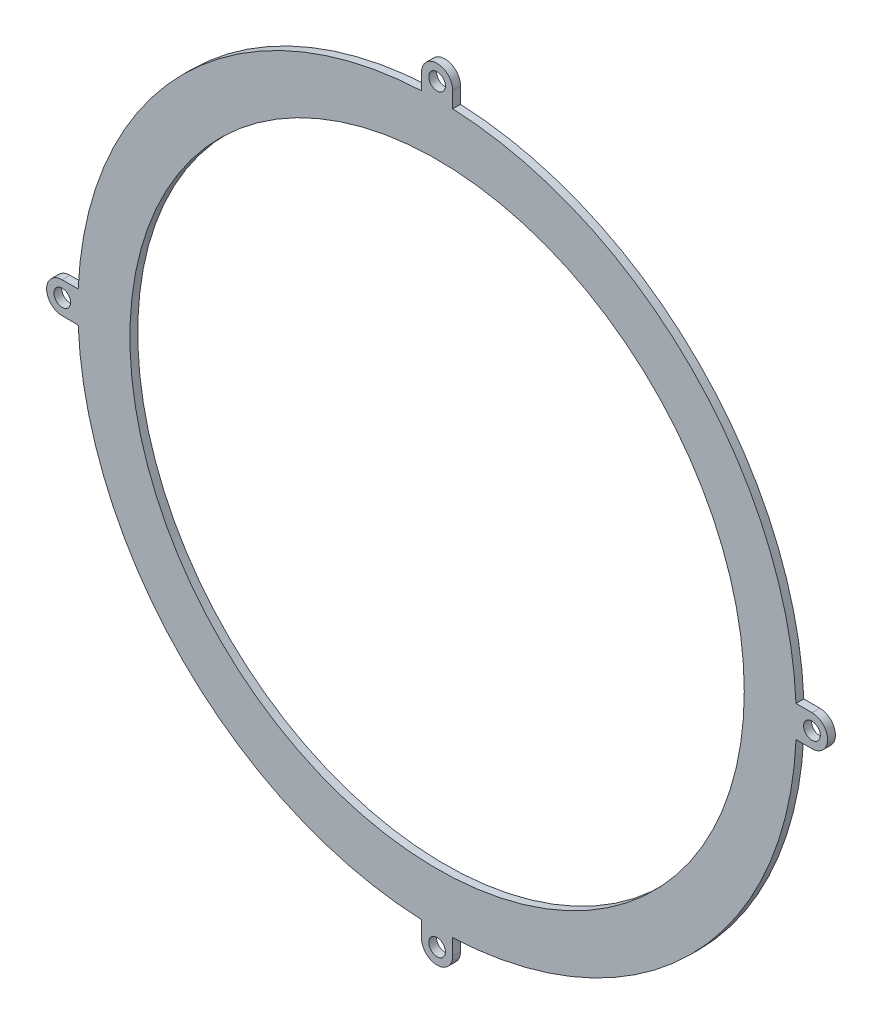
ISO-10303-21;
HEADER;
FILE_DESCRIPTION(('STEP AP214'),'2;1');
FILE_NAME('part.step','',(''),(''),'','','');
FILE_SCHEMA(('AUTOMOTIVE_DESIGN { 1 0 10303 214 1 1 1 1 }'));
ENDSEC;
DATA;
#1=APPLICATION_CONTEXT('core data for automotive mechanical design processes');
#2=APPLICATION_PROTOCOL_DEFINITION('international standard','automotive_design',2000,#1);
#3=PRODUCT_CONTEXT('',#1,'mechanical');
#4=PRODUCT('Part','Part','',(#3));
#5=PRODUCT_RELATED_PRODUCT_CATEGORY('part','',(#4));
#6=PRODUCT_DEFINITION_FORMATION('','',#4);
#7=PRODUCT_DEFINITION_CONTEXT('part definition',#1,'design');
#8=PRODUCT_DEFINITION('design','',#6,#7);
#9=PRODUCT_DEFINITION_SHAPE('','',#8);
#10=(LENGTH_UNIT() NAMED_UNIT(*) SI_UNIT(.MILLI.,.METRE.));
#11=(NAMED_UNIT(*) PLANE_ANGLE_UNIT() SI_UNIT($,.RADIAN.));
#12=(NAMED_UNIT(*) SI_UNIT($,.STERADIAN.) SOLID_ANGLE_UNIT());
#13=UNCERTAINTY_MEASURE_WITH_UNIT(LENGTH_MEASURE(1.E-05),#10,'distance_accuracy_value','');
#14=(GEOMETRIC_REPRESENTATION_CONTEXT(3) GLOBAL_UNCERTAINTY_ASSIGNED_CONTEXT((#13)) GLOBAL_UNIT_ASSIGNED_CONTEXT((#10,
#11,#12)) REPRESENTATION_CONTEXT('',''));
#15=CARTESIAN_POINT('',(0.,0.,0.));
#16=DIRECTION('',(0.,0.,1.));
#17=DIRECTION('',(1.,0.,0.));
#18=AXIS2_PLACEMENT_3D('',#15,#16,#17);
#19=CARTESIAN_POINT('',(0.,72.,1.5));
#20=DIRECTION('',(0.,0.,1.));
#21=DIRECTION('',(1.,0.,0.));
#22=AXIS2_PLACEMENT_3D('',#19,#20,#21);
#23=PLANE('',#22);
#24=CARTESIAN_POINT('',(-5.02773312793411E-13,-72.,1.5));
#25=DIRECTION('',(0.,0.,1.));
#26=DIRECTION('',(1.,0.,0.));
#27=AXIS2_PLACEMENT_3D('',#24,#25,#26);
#28=CIRCLE('',#27,1.6);
#29=CARTESIAN_POINT('',(1.5999999999995,-72.,1.5));
#30=VERTEX_POINT('',#29);
#31=EDGE_CURVE('E348',#30,#30,#28,.T.);
#32=ORIENTED_EDGE('',*,*,#31,.F.);
#33=EDGE_LOOP('',(#32));
#34=FACE_BOUND('',#33,.T.);
#35=CARTESIAN_POINT('',(0.,72.,1.5));
#36=DIRECTION('',(0.,0.,1.));
#37=DIRECTION('',(1.,0.,0.));
#38=AXIS2_PLACEMENT_3D('',#35,#36,#37);
#39=CIRCLE('',#38,1.6);
#40=CARTESIAN_POINT('',(1.6,72.,1.5));
#41=VERTEX_POINT('',#40);
#42=EDGE_CURVE('E360',#41,#41,#39,.T.);
#43=ORIENTED_EDGE('',*,*,#42,.F.);
#44=EDGE_LOOP('',(#43));
#45=FACE_BOUND('',#44,.T.);
#46=CARTESIAN_POINT('',(0.,72.,1.5));
#47=DIRECTION('',(0.,0.,1.));
#48=DIRECTION('',(1.,0.,0.));
#49=AXIS2_PLACEMENT_3D('',#46,#47,#48);
#50=CIRCLE('',#49,3.);
#51=CARTESIAN_POINT('',(3.,72.,1.5));
#52=VERTEX_POINT('',#51);
#53=CARTESIAN_POINT('',(-3.,72.,1.5));
#54=VERTEX_POINT('',#53);
#55=EDGE_CURVE('E210',#52,#54,#50,.T.);
#56=ORIENTED_EDGE('',*,*,#55,.T.);
#57=DIRECTION('',(0.,-1.,0.));
#58=VECTOR('',#57,1.);
#59=CARTESIAN_POINT('',(-3.,72.,1.5));
#60=LINE('',#59,#58);
#61=CARTESIAN_POINT('',(-3.,68.9347517584563,1.5));
#62=VERTEX_POINT('',#61);
#63=EDGE_CURVE('E118',#54,#62,#60,.T.);
#64=ORIENTED_EDGE('',*,*,#63,.T.);
#65=CARTESIAN_POINT('',(0.,0.,1.5));
#66=DIRECTION('',(0.,0.,1.));
#67=DIRECTION('',(1.,0.,0.));
#68=AXIS2_PLACEMENT_3D('',#65,#66,#67);
#69=CIRCLE('',#68,69.);
#70=CARTESIAN_POINT('',(-68.9347517584563,3.00000000000092,1.5));
#71=VERTEX_POINT('',#70);
#72=EDGE_CURVE('E249',#62,#71,#69,.T.);
#73=ORIENTED_EDGE('',*,*,#72,.T.);
#74=DIRECTION('',(-1.,0.,0.));
#75=VECTOR('',#74,1.);
#76=CARTESIAN_POINT('',(-68.9347517584563,3.00000000000092,1.5));
#77=LINE('',#76,#75);
#78=CARTESIAN_POINT('',(-72.,3.00000000000075,1.5));
#79=VERTEX_POINT('',#78);
#80=EDGE_CURVE('E268',#71,#79,#77,.T.);
#81=ORIENTED_EDGE('',*,*,#80,.T.);
#82=CARTESIAN_POINT('',(-72.,7.54159969190117E-13,1.5));
#83=DIRECTION('',(0.,0.,1.));
#84=DIRECTION('',(1.,0.,0.));
#85=AXIS2_PLACEMENT_3D('',#82,#83,#84);
#86=CIRCLE('',#85,3.);
#87=CARTESIAN_POINT('',(-72.,-2.99999999999925,1.5));
#88=VERTEX_POINT('',#87);
#89=EDGE_CURVE('E265',#79,#88,#86,.T.);
#90=ORIENTED_EDGE('',*,*,#89,.T.);
#91=DIRECTION('',(1.,0.,0.));
#92=VECTOR('',#91,1.);
#93=CARTESIAN_POINT('',(-72.,-2.99999999999925,1.5));
#94=LINE('',#93,#92);
#95=CARTESIAN_POINT('',(-68.9347517584564,-2.99999999999928,1.5));
#96=VERTEX_POINT('',#95);
#97=EDGE_CURVE('E267',#88,#96,#94,.T.);
#98=ORIENTED_EDGE('',*,*,#97,.T.);
#99=CARTESIAN_POINT('',(0.,0.,1.5));
#100=DIRECTION('',(0.,0.,1.));
#101=DIRECTION('',(1.,0.,0.));
#102=AXIS2_PLACEMENT_3D('',#99,#100,#101);
#103=CIRCLE('',#102,69.);
#104=CARTESIAN_POINT('',(-3.00000000000071,-68.9347517584563,1.5));
#105=VERTEX_POINT('',#104);
#106=EDGE_CURVE('E270',#96,#105,#103,.T.);
#107=ORIENTED_EDGE('',*,*,#106,.T.);
#108=DIRECTION('',(0.,-1.,0.));
#109=VECTOR('',#108,1.);
#110=CARTESIAN_POINT('',(-3.00000000000068,-68.9347517584563,1.5));
#111=LINE('',#110,#109);
#112=CARTESIAN_POINT('',(-3.0000000000005,-72.,1.5));
#113=VERTEX_POINT('',#112);
#114=EDGE_CURVE('E276',#105,#113,#111,.T.);
#115=ORIENTED_EDGE('',*,*,#114,.T.);
#116=CARTESIAN_POINT('',(-5.02773312793411E-13,-72.,1.5));
#117=DIRECTION('',(0.,0.,1.));
#118=DIRECTION('',(1.,0.,0.));
#119=AXIS2_PLACEMENT_3D('',#116,#117,#118);
#120=CIRCLE('',#119,3.);
#121=CARTESIAN_POINT('',(2.9999999999995,-72.,1.5));
#122=VERTEX_POINT('',#121);
#123=EDGE_CURVE('E278',#113,#122,#120,.T.);
#124=ORIENTED_EDGE('',*,*,#123,.T.);
#125=DIRECTION('',(0.,1.,0.));
#126=VECTOR('',#125,1.);
#127=CARTESIAN_POINT('',(2.9999999999995,-72.,1.5));
#128=LINE('',#127,#126);
#129=CARTESIAN_POINT('',(2.99999999999952,-68.9347517584564,1.5));
#130=VERTEX_POINT('',#129);
#131=EDGE_CURVE('E280',#122,#130,#128,.T.);
#132=ORIENTED_EDGE('',*,*,#131,.T.);
#133=CARTESIAN_POINT('',(0.,0.,1.5));
#134=DIRECTION('',(0.,0.,1.));
#135=DIRECTION('',(1.,0.,0.));
#136=AXIS2_PLACEMENT_3D('',#133,#134,#135);
#137=CIRCLE('',#136,69.);
#138=CARTESIAN_POINT('',(68.9347517584563,-3.00000000000047,1.5));
#139=VERTEX_POINT('',#138);
#140=EDGE_CURVE('E282',#130,#139,#137,.T.);
#141=ORIENTED_EDGE('',*,*,#140,.T.);
#142=DIRECTION('',(1.,0.,0.));
#143=VECTOR('',#142,1.);
#144=CARTESIAN_POINT('',(68.9347517584563,-3.00000000000044,1.5));
#145=LINE('',#144,#143);
#146=CARTESIAN_POINT('',(72.,-3.00000000000025,1.5));
#147=VERTEX_POINT('',#146);
#148=EDGE_CURVE('E284',#139,#147,#145,.T.);
#149=ORIENTED_EDGE('',*,*,#148,.T.);
#150=CARTESIAN_POINT('',(72.,-2.51386656396706E-13,1.5));
#151=DIRECTION('',(0.,0.,1.));
#152=DIRECTION('',(1.,0.,0.));
#153=AXIS2_PLACEMENT_3D('',#150,#151,#152);
#154=CIRCLE('',#153,3.);
#155=CARTESIAN_POINT('',(72.,2.99999999999975,1.5));
#156=VERTEX_POINT('',#155);
#157=EDGE_CURVE('E161',#147,#156,#154,.T.);
#158=ORIENTED_EDGE('',*,*,#157,.T.);
#159=DIRECTION('',(-1.,0.,0.));
#160=VECTOR('',#159,1.);
#161=CARTESIAN_POINT('',(72.,2.99999999999975,1.5));
#162=LINE('',#161,#160);
#163=CARTESIAN_POINT('',(68.9347517584563,2.99999999999976,1.5));
#164=VERTEX_POINT('',#163);
#165=EDGE_CURVE('E155',#156,#164,#162,.T.);
#166=ORIENTED_EDGE('',*,*,#165,.T.);
#167=CARTESIAN_POINT('',(0.,0.,1.5));
#168=DIRECTION('',(0.,0.,1.));
#169=DIRECTION('',(1.,0.,0.));
#170=AXIS2_PLACEMENT_3D('',#167,#168,#169);
#171=CIRCLE('',#170,69.);
#172=CARTESIAN_POINT('',(3.0000000000002,68.9347517584563,1.5));
#173=VERTEX_POINT('',#172);
#174=EDGE_CURVE('E159',#164,#173,#171,.T.);
#175=ORIENTED_EDGE('',*,*,#174,.T.);
#176=DIRECTION('',(0.,1.,0.));
#177=VECTOR('',#176,1.);
#178=CARTESIAN_POINT('',(3.0000000000002,68.9347517584563,1.5));
#179=LINE('',#178,#177);
#180=EDGE_CURVE('E51',#173,#52,#179,.T.);
#181=ORIENTED_EDGE('',*,*,#180,.T.);
#182=EDGE_LOOP('',(#56,#64,#73,#81,#90,#98,#107,#115,#124,#132,#141,#149,#158,#166,#175,#181));
#183=FACE_BOUND('',#182,.T.);
#184=CARTESIAN_POINT('',(0.,0.,1.5));
#185=DIRECTION('',(0.,0.,1.));
#186=DIRECTION('',(1.,0.,0.));
#187=AXIS2_PLACEMENT_3D('',#184,#185,#186);
#188=CIRCLE('',#187,59.);
#189=CARTESIAN_POINT('',(59.,0.,1.5));
#190=VERTEX_POINT('',#189);
#191=EDGE_CURVE('E183',#190,#190,#188,.T.);
#192=ORIENTED_EDGE('',*,*,#191,.F.);
#193=EDGE_LOOP('',(#192));
#194=FACE_BOUND('',#193,.T.);
#195=CARTESIAN_POINT('',(72.,-2.51386656396706E-13,1.5));
#196=DIRECTION('',(0.,0.,1.));
#197=DIRECTION('',(1.,0.,0.));
#198=AXIS2_PLACEMENT_3D('',#195,#196,#197);
#199=CIRCLE('',#198,1.6);
#200=CARTESIAN_POINT('',(73.6,-2.51386656396706E-13,1.5));
#201=VERTEX_POINT('',#200);
#202=EDGE_CURVE('E354',#201,#201,#199,.T.);
#203=ORIENTED_EDGE('',*,*,#202,.F.);
#204=EDGE_LOOP('',(#203));
#205=FACE_BOUND('',#204,.T.);
#206=CARTESIAN_POINT('',(-72.,7.54159969190117E-13,1.5));
#207=DIRECTION('',(0.,0.,1.));
#208=DIRECTION('',(1.,0.,0.));
#209=AXIS2_PLACEMENT_3D('',#206,#207,#208);
#210=CIRCLE('',#209,1.6);
#211=CARTESIAN_POINT('',(-70.4,7.54159969190117E-13,1.5));
#212=VERTEX_POINT('',#211);
#213=EDGE_CURVE('E339',#212,#212,#210,.T.);
#214=ORIENTED_EDGE('',*,*,#213,.F.);
#215=EDGE_LOOP('',(#214));
#216=FACE_BOUND('',#215,.T.);
#217=ADVANCED_FACE('F34',(#34,#45,#183,#194,#205,#216),#23,.T.);
#218=CARTESIAN_POINT('',(0.,72.,0.));
#219=DIRECTION('',(0.,0.,1.));
#220=DIRECTION('',(1.,0.,0.));
#221=AXIS2_PLACEMENT_3D('',#218,#219,#220);
#222=PLANE('',#221);
#223=CARTESIAN_POINT('',(0.,72.,0.));
#224=DIRECTION('',(0.,0.,1.));
#225=DIRECTION('',(1.,0.,0.));
#226=AXIS2_PLACEMENT_3D('',#223,#224,#225);
#227=CIRCLE('',#226,3.);
#228=CARTESIAN_POINT('',(3.,72.,0.));
#229=VERTEX_POINT('',#228);
#230=CARTESIAN_POINT('',(-3.,72.,0.));
#231=VERTEX_POINT('',#230);
#232=EDGE_CURVE('E179',#229,#231,#227,.T.);
#233=ORIENTED_EDGE('',*,*,#232,.F.);
#234=DIRECTION('',(0.,1.,0.));
#235=VECTOR('',#234,1.);
#236=CARTESIAN_POINT('',(3.0000000000002,68.9347517584563,0.));
#237=LINE('',#236,#235);
#238=CARTESIAN_POINT('',(3.0000000000002,68.9347517584563,0.));
#239=VERTEX_POINT('',#238);
#240=EDGE_CURVE('E110',#239,#229,#237,.T.);
#241=ORIENTED_EDGE('',*,*,#240,.F.);
#242=CARTESIAN_POINT('',(0.,0.,0.));
#243=DIRECTION('',(0.,0.,1.));
#244=DIRECTION('',(1.,0.,0.));
#245=AXIS2_PLACEMENT_3D('',#242,#243,#244);
#246=CIRCLE('',#245,69.);
#247=CARTESIAN_POINT('',(68.9347517584563,2.99999999999976,0.));
#248=VERTEX_POINT('',#247);
#249=EDGE_CURVE('E104',#248,#239,#246,.T.);
#250=ORIENTED_EDGE('',*,*,#249,.F.);
#251=DIRECTION('',(-1.,0.,0.));
#252=VECTOR('',#251,1.);
#253=CARTESIAN_POINT('',(72.,2.99999999999975,0.));
#254=LINE('',#253,#252);
#255=CARTESIAN_POINT('',(72.,2.99999999999975,0.));
#256=VERTEX_POINT('',#255);
#257=EDGE_CURVE('E169',#256,#248,#254,.T.);
#258=ORIENTED_EDGE('',*,*,#257,.F.);
#259=CARTESIAN_POINT('',(72.,-2.51386656396706E-13,0.));
#260=DIRECTION('',(0.,0.,1.));
#261=DIRECTION('',(1.,0.,0.));
#262=AXIS2_PLACEMENT_3D('',#259,#260,#261);
#263=CIRCLE('',#262,3.);
#264=CARTESIAN_POINT('',(72.,-3.00000000000025,0.));
#265=VERTEX_POINT('',#264);
#266=EDGE_CURVE('E205',#265,#256,#263,.T.);
#267=ORIENTED_EDGE('',*,*,#266,.F.);
#268=DIRECTION('',(1.,0.,0.));
#269=VECTOR('',#268,1.);
#270=CARTESIAN_POINT('',(68.9347517584563,-3.00000000000044,0.));
#271=LINE('',#270,#269);
#272=CARTESIAN_POINT('',(68.9347517584563,-3.00000000000047,0.));
#273=VERTEX_POINT('',#272);
#274=EDGE_CURVE('E203',#273,#265,#271,.T.);
#275=ORIENTED_EDGE('',*,*,#274,.F.);
#276=CARTESIAN_POINT('',(0.,0.,0.));
#277=DIRECTION('',(0.,0.,1.));
#278=DIRECTION('',(1.,0.,0.));
#279=AXIS2_PLACEMENT_3D('',#276,#277,#278);
#280=CIRCLE('',#279,69.);
#281=CARTESIAN_POINT('',(2.99999999999952,-68.9347517584564,0.));
#282=VERTEX_POINT('',#281);
#283=EDGE_CURVE('E201',#282,#273,#280,.T.);
#284=ORIENTED_EDGE('',*,*,#283,.F.);
#285=DIRECTION('',(0.,1.,0.));
#286=VECTOR('',#285,1.);
#287=CARTESIAN_POINT('',(2.9999999999995,-72.,0.));
#288=LINE('',#287,#286);
#289=CARTESIAN_POINT('',(2.9999999999995,-72.,0.));
#290=VERTEX_POINT('',#289);
#291=EDGE_CURVE('E199',#290,#282,#288,.T.);
#292=ORIENTED_EDGE('',*,*,#291,.F.);
#293=CARTESIAN_POINT('',(-5.02773312793411E-13,-72.,0.));
#294=DIRECTION('',(0.,0.,1.));
#295=DIRECTION('',(1.,0.,0.));
#296=AXIS2_PLACEMENT_3D('',#293,#294,#295);
#297=CIRCLE('',#296,3.);
#298=CARTESIAN_POINT('',(-3.0000000000005,-72.,0.));
#299=VERTEX_POINT('',#298);
#300=EDGE_CURVE('E197',#299,#290,#297,.T.);
#301=ORIENTED_EDGE('',*,*,#300,.F.);
#302=DIRECTION('',(0.,-1.,0.));
#303=VECTOR('',#302,1.);
#304=CARTESIAN_POINT('',(-3.00000000000068,-68.9347517584563,0.));
#305=LINE('',#304,#303);
#306=CARTESIAN_POINT('',(-3.00000000000071,-68.9347517584563,0.));
#307=VERTEX_POINT('',#306);
#308=EDGE_CURVE('E195',#307,#299,#305,.T.);
#309=ORIENTED_EDGE('',*,*,#308,.F.);
#310=CARTESIAN_POINT('',(0.,0.,0.));
#311=DIRECTION('',(0.,0.,1.));
#312=DIRECTION('',(1.,0.,0.));
#313=AXIS2_PLACEMENT_3D('',#310,#311,#312);
#314=CIRCLE('',#313,69.);
#315=CARTESIAN_POINT('',(-68.9347517584564,-2.99999999999928,0.));
#316=VERTEX_POINT('',#315);
#317=EDGE_CURVE('E193',#316,#307,#314,.T.);
#318=ORIENTED_EDGE('',*,*,#317,.F.);
#319=DIRECTION('',(1.,0.,0.));
#320=VECTOR('',#319,1.);
#321=CARTESIAN_POINT('',(-72.,-2.99999999999925,0.));
#322=LINE('',#321,#320);
#323=CARTESIAN_POINT('',(-72.,-2.99999999999925,0.));
#324=VERTEX_POINT('',#323);
#325=EDGE_CURVE('E191',#324,#316,#322,.T.);
#326=ORIENTED_EDGE('',*,*,#325,.F.);
#327=CARTESIAN_POINT('',(-72.,7.54159969190117E-13,0.));
#328=DIRECTION('',(0.,0.,1.));
#329=DIRECTION('',(1.,0.,0.));
#330=AXIS2_PLACEMENT_3D('',#327,#328,#329);
#331=CIRCLE('',#330,3.);
#332=CARTESIAN_POINT('',(-72.,3.00000000000075,0.));
#333=VERTEX_POINT('',#332);
#334=EDGE_CURVE('E189',#333,#324,#331,.T.);
#335=ORIENTED_EDGE('',*,*,#334,.F.);
#336=DIRECTION('',(-1.,0.,0.));
#337=VECTOR('',#336,1.);
#338=CARTESIAN_POINT('',(-68.9347517584563,3.00000000000092,0.));
#339=LINE('',#338,#337);
#340=CARTESIAN_POINT('',(-68.9347517584563,3.00000000000092,0.));
#341=VERTEX_POINT('',#340);
#342=EDGE_CURVE('E187',#341,#333,#339,.T.);
#343=ORIENTED_EDGE('',*,*,#342,.F.);
#344=CARTESIAN_POINT('',(0.,0.,0.));
#345=DIRECTION('',(0.,0.,1.));
#346=DIRECTION('',(1.,0.,0.));
#347=AXIS2_PLACEMENT_3D('',#344,#345,#346);
#348=CIRCLE('',#347,69.);
#349=CARTESIAN_POINT('',(-3.,68.9347517584563,0.));
#350=VERTEX_POINT('',#349);
#351=EDGE_CURVE('E185',#350,#341,#348,.T.);
#352=ORIENTED_EDGE('',*,*,#351,.F.);
#353=DIRECTION('',(0.,-1.,0.));
#354=VECTOR('',#353,1.);
#355=CARTESIAN_POINT('',(-3.,72.,0.));
#356=LINE('',#355,#354);
#357=EDGE_CURVE('E182',#231,#350,#356,.T.);
#358=ORIENTED_EDGE('',*,*,#357,.F.);
#359=EDGE_LOOP('',(#233,#241,#250,#258,#267,#275,#284,#292,#301,#309,#318,#326,#335,#343,#352,#358));
#360=FACE_BOUND('',#359,.T.);
#361=CARTESIAN_POINT('',(0.,0.,0.));
#362=DIRECTION('',(0.,0.,1.));
#363=DIRECTION('',(1.,0.,0.));
#364=AXIS2_PLACEMENT_3D('',#361,#362,#363);
#365=CIRCLE('',#364,59.);
#366=CARTESIAN_POINT('',(59.,0.,0.));
#367=VERTEX_POINT('',#366);
#368=EDGE_CURVE('E363',#367,#367,#365,.T.);
#369=ORIENTED_EDGE('',*,*,#368,.T.);
#370=EDGE_LOOP('',(#369));
#371=FACE_BOUND('',#370,.T.);
#372=CARTESIAN_POINT('',(0.,72.,0.));
#373=DIRECTION('',(0.,0.,1.));
#374=DIRECTION('',(1.,0.,0.));
#375=AXIS2_PLACEMENT_3D('',#372,#373,#374);
#376=CIRCLE('',#375,1.6);
#377=CARTESIAN_POINT('',(1.6,72.,0.));
#378=VERTEX_POINT('',#377);
#379=EDGE_CURVE('E357',#378,#378,#376,.T.);
#380=ORIENTED_EDGE('',*,*,#379,.T.);
#381=EDGE_LOOP('',(#380));
#382=FACE_BOUND('',#381,.T.);
#383=CARTESIAN_POINT('',(72.,-2.51386656396706E-13,0.));
#384=DIRECTION('',(0.,0.,1.));
#385=DIRECTION('',(1.,0.,0.));
#386=AXIS2_PLACEMENT_3D('',#383,#384,#385);
#387=CIRCLE('',#386,1.6);
#388=CARTESIAN_POINT('',(73.6,-2.51386656396706E-13,0.));
#389=VERTEX_POINT('',#388);
#390=EDGE_CURVE('E351',#389,#389,#387,.T.);
#391=ORIENTED_EDGE('',*,*,#390,.T.);
#392=EDGE_LOOP('',(#391));
#393=FACE_BOUND('',#392,.T.);
#394=CARTESIAN_POINT('',(-5.02773312793411E-13,-72.,0.));
#395=DIRECTION('',(0.,0.,1.));
#396=DIRECTION('',(1.,0.,0.));
#397=AXIS2_PLACEMENT_3D('',#394,#395,#396);
#398=CIRCLE('',#397,1.6);
#399=CARTESIAN_POINT('',(1.5999999999995,-72.,0.));
#400=VERTEX_POINT('',#399);
#401=EDGE_CURVE('E345',#400,#400,#398,.T.);
#402=ORIENTED_EDGE('',*,*,#401,.T.);
#403=EDGE_LOOP('',(#402));
#404=FACE_BOUND('',#403,.T.);
#405=CARTESIAN_POINT('',(-72.,7.54159969190117E-13,0.));
#406=DIRECTION('',(0.,0.,1.));
#407=DIRECTION('',(1.,0.,0.));
#408=AXIS2_PLACEMENT_3D('',#405,#406,#407);
#409=CIRCLE('',#408,1.6);
#410=CARTESIAN_POINT('',(-70.4,7.54159969190117E-13,0.));
#411=VERTEX_POINT('',#410);
#412=EDGE_CURVE('E342',#411,#411,#409,.T.);
#413=ORIENTED_EDGE('',*,*,#412,.T.);
#414=EDGE_LOOP('',(#413));
#415=FACE_BOUND('',#414,.T.);
#416=ADVANCED_FACE('F253',(#360,#371,#382,#393,#404,#415),#222,.F.);
#417=CARTESIAN_POINT('',(0.,72.,1.5));
#418=DIRECTION('',(0.,0.,-1.));
#419=DIRECTION('',(-1.,0.,0.));
#420=AXIS2_PLACEMENT_3D('',#417,#418,#419);
#421=CYLINDRICAL_SURFACE('',#420,3.);
#422=ORIENTED_EDGE('',*,*,#232,.T.);
#423=DIRECTION('',(0.,0.,-1.));
#424=VECTOR('',#423,1.);
#425=CARTESIAN_POINT('',(-3.,72.,1.5));
#426=LINE('',#425,#424);
#427=EDGE_CURVE('E11',#54,#231,#426,.T.);
#428=ORIENTED_EDGE('',*,*,#427,.F.);
#429=ORIENTED_EDGE('',*,*,#55,.F.);
#430=DIRECTION('',(0.,0.,-1.));
#431=VECTOR('',#430,1.);
#432=CARTESIAN_POINT('',(3.,72.,1.5));
#433=LINE('',#432,#431);
#434=EDGE_CURVE('E175',#52,#229,#433,.T.);
#435=ORIENTED_EDGE('',*,*,#434,.T.);
#436=EDGE_LOOP('',(#422,#428,#429,#435));
#437=FACE_BOUND('',#436,.T.);
#438=ADVANCED_FACE('F36',(#437),#421,.T.);
#439=CARTESIAN_POINT('',(-3.,72.,1.5));
#440=DIRECTION('',(1.,0.,0.));
#441=DIRECTION('',(0.,0.,-1.));
#442=AXIS2_PLACEMENT_3D('',#439,#440,#441);
#443=PLANE('',#442);
#444=ORIENTED_EDGE('',*,*,#357,.T.);
#445=DIRECTION('',(0.,0.,-1.));
#446=VECTOR('',#445,1.);
#447=CARTESIAN_POINT('',(-3.,68.9347517584563,1.5));
#448=LINE('',#447,#446);
#449=EDGE_CURVE('E43',#62,#350,#448,.T.);
#450=ORIENTED_EDGE('',*,*,#449,.F.);
#451=ORIENTED_EDGE('',*,*,#63,.F.);
#452=ORIENTED_EDGE('',*,*,#427,.T.);
#453=EDGE_LOOP('',(#444,#450,#451,#452));
#454=FACE_BOUND('',#453,.T.);
#455=ADVANCED_FACE('F522',(#454),#443,.F.);
#456=CARTESIAN_POINT('',(0.,0.,1.5));
#457=DIRECTION('',(0.,0.,-1.));
#458=DIRECTION('',(-1.,0.,0.));
#459=AXIS2_PLACEMENT_3D('',#456,#457,#458);
#460=CYLINDRICAL_SURFACE('',#459,69.);
#461=ORIENTED_EDGE('',*,*,#351,.T.);
#462=DIRECTION('',(0.,0.,-1.));
#463=VECTOR('',#462,1.);
#464=CARTESIAN_POINT('',(-68.9347517584563,3.00000000000092,1.5));
#465=LINE('',#464,#463);
#466=EDGE_CURVE('E241',#71,#341,#465,.T.);
#467=ORIENTED_EDGE('',*,*,#466,.F.);
#468=ORIENTED_EDGE('',*,*,#72,.F.);
#469=ORIENTED_EDGE('',*,*,#449,.T.);
#470=EDGE_LOOP('',(#461,#467,#468,#469));
#471=FACE_BOUND('',#470,.T.);
#472=ADVANCED_FACE('F247',(#471),#460,.T.);
#473=CARTESIAN_POINT('',(-68.9347517584563,3.00000000000092,1.5));
#474=DIRECTION('',(0.,-1.,0.));
#475=DIRECTION('',(1.,0.,0.));
#476=AXIS2_PLACEMENT_3D('',#473,#474,#475);
#477=PLANE('',#476);
#478=ORIENTED_EDGE('',*,*,#342,.T.);
#479=DIRECTION('',(0.,0.,-1.));
#480=VECTOR('',#479,1.);
#481=CARTESIAN_POINT('',(-72.,3.00000000000075,1.5));
#482=LINE('',#481,#480);
#483=EDGE_CURVE('E238',#79,#333,#482,.T.);
#484=ORIENTED_EDGE('',*,*,#483,.F.);
#485=ORIENTED_EDGE('',*,*,#80,.F.);
#486=ORIENTED_EDGE('',*,*,#466,.T.);
#487=EDGE_LOOP('',(#478,#484,#485,#486));
#488=FACE_BOUND('',#487,.T.);
#489=ADVANCED_FACE('F259',(#488),#477,.F.);
#490=CARTESIAN_POINT('',(-72.,7.54159969190117E-13,1.5));
#491=DIRECTION('',(0.,0.,-1.));
#492=DIRECTION('',(-1.,0.,0.));
#493=AXIS2_PLACEMENT_3D('',#490,#491,#492);
#494=CYLINDRICAL_SURFACE('',#493,3.);
#495=ORIENTED_EDGE('',*,*,#334,.T.);
#496=DIRECTION('',(0.,0.,-1.));
#497=VECTOR('',#496,1.);
#498=CARTESIAN_POINT('',(-72.,-2.99999999999925,1.5));
#499=LINE('',#498,#497);
#500=EDGE_CURVE('E235',#88,#324,#499,.T.);
#501=ORIENTED_EDGE('',*,*,#500,.F.);
#502=ORIENTED_EDGE('',*,*,#89,.F.);
#503=ORIENTED_EDGE('',*,*,#483,.T.);
#504=EDGE_LOOP('',(#495,#501,#502,#503));
#505=FACE_BOUND('',#504,.T.);
#506=ADVANCED_FACE('F263',(#505),#494,.T.);
#507=CARTESIAN_POINT('',(-72.,-2.99999999999925,1.5));
#508=DIRECTION('',(0.,1.,0.));
#509=DIRECTION('',(-1.,0.,0.));
#510=AXIS2_PLACEMENT_3D('',#507,#508,#509);
#511=PLANE('',#510);
#512=ORIENTED_EDGE('',*,*,#325,.T.);
#513=DIRECTION('',(0.,0.,-1.));
#514=VECTOR('',#513,1.);
#515=CARTESIAN_POINT('',(-68.9347517584564,-2.99999999999928,1.5));
#516=LINE('',#515,#514);
#517=EDGE_CURVE('E232',#96,#316,#516,.T.);
#518=ORIENTED_EDGE('',*,*,#517,.F.);
#519=ORIENTED_EDGE('',*,*,#97,.F.);
#520=ORIENTED_EDGE('',*,*,#500,.T.);
#521=EDGE_LOOP('',(#512,#518,#519,#520));
#522=FACE_BOUND('',#521,.T.);
#523=ADVANCED_FACE('F487',(#522),#511,.F.);
#524=CARTESIAN_POINT('',(0.,0.,1.5));
#525=DIRECTION('',(0.,0.,-1.));
#526=DIRECTION('',(-1.,0.,0.));
#527=AXIS2_PLACEMENT_3D('',#524,#525,#526);
#528=CYLINDRICAL_SURFACE('',#527,69.);
#529=ORIENTED_EDGE('',*,*,#317,.T.);
#530=DIRECTION('',(0.,0.,-1.));
#531=VECTOR('',#530,1.);
#532=CARTESIAN_POINT('',(-3.00000000000071,-68.9347517584563,1.5));
#533=LINE('',#532,#531);
#534=EDGE_CURVE('E229',#105,#307,#533,.T.);
#535=ORIENTED_EDGE('',*,*,#534,.F.);
#536=ORIENTED_EDGE('',*,*,#106,.F.);
#537=ORIENTED_EDGE('',*,*,#517,.T.);
#538=EDGE_LOOP('',(#529,#535,#536,#537));
#539=FACE_BOUND('',#538,.T.);
#540=ADVANCED_FACE('F477',(#539),#528,.T.);
#541=CARTESIAN_POINT('',(-3.00000000000068,-68.9347517584563,1.5));
#542=DIRECTION('',(1.,0.,0.));
#543=DIRECTION('',(0.,1.,0.));
#544=AXIS2_PLACEMENT_3D('',#541,#542,#543);
#545=PLANE('',#544);
#546=ORIENTED_EDGE('',*,*,#308,.T.);
#547=DIRECTION('',(0.,0.,-1.));
#548=VECTOR('',#547,1.);
#549=CARTESIAN_POINT('',(-3.0000000000005,-72.,1.5));
#550=LINE('',#549,#548);
#551=EDGE_CURVE('E226',#113,#299,#550,.T.);
#552=ORIENTED_EDGE('',*,*,#551,.F.);
#553=ORIENTED_EDGE('',*,*,#114,.F.);
#554=ORIENTED_EDGE('',*,*,#534,.T.);
#555=EDGE_LOOP('',(#546,#552,#553,#554));
#556=FACE_BOUND('',#555,.T.);
#557=ADVANCED_FACE('F467',(#556),#545,.F.);
#558=CARTESIAN_POINT('',(-5.02773312793411E-13,-72.,1.5));
#559=DIRECTION('',(0.,0.,-1.));
#560=DIRECTION('',(-1.,0.,0.));
#561=AXIS2_PLACEMENT_3D('',#558,#559,#560);
#562=CYLINDRICAL_SURFACE('',#561,3.);
#563=ORIENTED_EDGE('',*,*,#300,.T.);
#564=DIRECTION('',(0.,0.,-1.));
#565=VECTOR('',#564,1.);
#566=CARTESIAN_POINT('',(2.9999999999995,-72.,1.5));
#567=LINE('',#566,#565);
#568=EDGE_CURVE('E223',#122,#290,#567,.T.);
#569=ORIENTED_EDGE('',*,*,#568,.F.);
#570=ORIENTED_EDGE('',*,*,#123,.F.);
#571=ORIENTED_EDGE('',*,*,#551,.T.);
#572=EDGE_LOOP('',(#563,#569,#570,#571));
#573=FACE_BOUND('',#572,.T.);
#574=ADVANCED_FACE('F457',(#573),#562,.T.);
#575=CARTESIAN_POINT('',(2.9999999999995,-72.,1.5));
#576=DIRECTION('',(-1.,0.,0.));
#577=DIRECTION('',(0.,-1.,0.));
#578=AXIS2_PLACEMENT_3D('',#575,#576,#577);
#579=PLANE('',#578);
#580=ORIENTED_EDGE('',*,*,#291,.T.);
#581=DIRECTION('',(0.,0.,-1.));
#582=VECTOR('',#581,1.);
#583=CARTESIAN_POINT('',(2.99999999999952,-68.9347517584564,1.5));
#584=LINE('',#583,#582);
#585=EDGE_CURVE('E220',#130,#282,#584,.T.);
#586=ORIENTED_EDGE('',*,*,#585,.F.);
#587=ORIENTED_EDGE('',*,*,#131,.F.);
#588=ORIENTED_EDGE('',*,*,#568,.T.);
#589=EDGE_LOOP('',(#580,#586,#587,#588));
#590=FACE_BOUND('',#589,.T.);
#591=ADVANCED_FACE('F447',(#590),#579,.F.);
#592=CARTESIAN_POINT('',(0.,0.,1.5));
#593=DIRECTION('',(0.,0.,-1.));
#594=DIRECTION('',(-1.,0.,0.));
#595=AXIS2_PLACEMENT_3D('',#592,#593,#594);
#596=CYLINDRICAL_SURFACE('',#595,69.);
#597=ORIENTED_EDGE('',*,*,#283,.T.);
#598=DIRECTION('',(0.,0.,-1.));
#599=VECTOR('',#598,1.);
#600=CARTESIAN_POINT('',(68.9347517584563,-3.00000000000047,1.5));
#601=LINE('',#600,#599);
#602=EDGE_CURVE('E217',#139,#273,#601,.T.);
#603=ORIENTED_EDGE('',*,*,#602,.F.);
#604=ORIENTED_EDGE('',*,*,#140,.F.);
#605=ORIENTED_EDGE('',*,*,#585,.T.);
#606=EDGE_LOOP('',(#597,#603,#604,#605));
#607=FACE_BOUND('',#606,.T.);
#608=ADVANCED_FACE('F438',(#607),#596,.T.);
#609=CARTESIAN_POINT('',(68.9347517584563,-3.00000000000044,1.5));
#610=DIRECTION('',(0.,1.,0.));
#611=DIRECTION('',(-1.,0.,0.));
#612=AXIS2_PLACEMENT_3D('',#609,#610,#611);
#613=PLANE('',#612);
#614=ORIENTED_EDGE('',*,*,#274,.T.);
#615=DIRECTION('',(0.,0.,-1.));
#616=VECTOR('',#615,1.);
#617=CARTESIAN_POINT('',(72.,-3.00000000000025,1.5));
#618=LINE('',#617,#616);
#619=EDGE_CURVE('E214',#147,#265,#618,.T.);
#620=ORIENTED_EDGE('',*,*,#619,.F.);
#621=ORIENTED_EDGE('',*,*,#148,.F.);
#622=ORIENTED_EDGE('',*,*,#602,.T.);
#623=EDGE_LOOP('',(#614,#620,#621,#622));
#624=FACE_BOUND('',#623,.T.);
#625=ADVANCED_FACE('F290',(#624),#613,.F.);
#626=CARTESIAN_POINT('',(72.,-2.51386656396706E-13,1.5));
#627=DIRECTION('',(0.,0.,-1.));
#628=DIRECTION('',(-1.,0.,0.));
#629=AXIS2_PLACEMENT_3D('',#626,#627,#628);
#630=CYLINDRICAL_SURFACE('',#629,3.);
#631=ORIENTED_EDGE('',*,*,#266,.T.);
#632=DIRECTION('',(0.,0.,-1.));
#633=VECTOR('',#632,1.);
#634=CARTESIAN_POINT('',(72.,2.99999999999975,1.5));
#635=LINE('',#634,#633);
#636=EDGE_CURVE('E170',#156,#256,#635,.T.);
#637=ORIENTED_EDGE('',*,*,#636,.F.);
#638=ORIENTED_EDGE('',*,*,#157,.F.);
#639=ORIENTED_EDGE('',*,*,#619,.T.);
#640=EDGE_LOOP('',(#631,#637,#638,#639));
#641=FACE_BOUND('',#640,.T.);
#642=ADVANCED_FACE('F294',(#641),#630,.T.);
#643=CARTESIAN_POINT('',(72.,2.99999999999975,1.5));
#644=DIRECTION('',(0.,-1.,0.));
#645=DIRECTION('',(1.,0.,0.));
#646=AXIS2_PLACEMENT_3D('',#643,#644,#645);
#647=PLANE('',#646);
#648=ORIENTED_EDGE('',*,*,#257,.T.);
#649=DIRECTION('',(0.,0.,-1.));
#650=VECTOR('',#649,1.);
#651=CARTESIAN_POINT('',(68.9347517584563,2.99999999999976,1.5));
#652=LINE('',#651,#650);
#653=EDGE_CURVE('E166',#164,#248,#652,.T.);
#654=ORIENTED_EDGE('',*,*,#653,.F.);
#655=ORIENTED_EDGE('',*,*,#165,.F.);
#656=ORIENTED_EDGE('',*,*,#636,.T.);
#657=EDGE_LOOP('',(#648,#654,#655,#656));
#658=FACE_BOUND('',#657,.T.);
#659=ADVANCED_FACE('F167',(#658),#647,.F.);
#660=CARTESIAN_POINT('',(0.,0.,1.5));
#661=DIRECTION('',(0.,0.,-1.));
#662=DIRECTION('',(-1.,0.,0.));
#663=AXIS2_PLACEMENT_3D('',#660,#661,#662);
#664=CYLINDRICAL_SURFACE('',#663,69.);
#665=ORIENTED_EDGE('',*,*,#249,.T.);
#666=DIRECTION('',(0.,0.,-1.));
#667=VECTOR('',#666,1.);
#668=CARTESIAN_POINT('',(3.0000000000002,68.9347517584563,1.5));
#669=LINE('',#668,#667);
#670=EDGE_CURVE('E171',#173,#239,#669,.T.);
#671=ORIENTED_EDGE('',*,*,#670,.F.);
#672=ORIENTED_EDGE('',*,*,#174,.F.);
#673=ORIENTED_EDGE('',*,*,#653,.T.);
#674=EDGE_LOOP('',(#665,#671,#672,#673));
#675=FACE_BOUND('',#674,.T.);
#676=ADVANCED_FACE('F173',(#675),#664,.T.);
#677=CARTESIAN_POINT('',(3.0000000000002,68.9347517584563,1.5));
#678=DIRECTION('',(-1.,0.,0.));
#679=DIRECTION('',(0.,-1.,0.));
#680=AXIS2_PLACEMENT_3D('',#677,#678,#679);
#681=PLANE('',#680);
#682=ORIENTED_EDGE('',*,*,#240,.T.);
#683=ORIENTED_EDGE('',*,*,#434,.F.);
#684=ORIENTED_EDGE('',*,*,#180,.F.);
#685=ORIENTED_EDGE('',*,*,#670,.T.);
#686=EDGE_LOOP('',(#682,#683,#684,#685));
#687=FACE_BOUND('',#686,.T.);
#688=ADVANCED_FACE('F298',(#687),#681,.F.);
#689=CARTESIAN_POINT('',(0.,0.,1.5));
#690=DIRECTION('',(0.,0.,-1.));
#691=DIRECTION('',(-1.,0.,0.));
#692=AXIS2_PLACEMENT_3D('',#689,#690,#691);
#693=CYLINDRICAL_SURFACE('',#692,59.);
#694=ORIENTED_EDGE('',*,*,#191,.T.);
#695=EDGE_LOOP('',(#694));
#696=FACE_BOUND('',#695,.T.);
#697=ORIENTED_EDGE('',*,*,#368,.F.);
#698=EDGE_LOOP('',(#697));
#699=FACE_BOUND('',#698,.T.);
#700=ADVANCED_FACE('F300',(#696,#699),#693,.F.);
#701=CARTESIAN_POINT('',(0.,72.,1.5));
#702=DIRECTION('',(0.,0.,-1.));
#703=DIRECTION('',(-1.,0.,0.));
#704=AXIS2_PLACEMENT_3D('',#701,#702,#703);
#705=CYLINDRICAL_SURFACE('',#704,1.6);
#706=ORIENTED_EDGE('',*,*,#42,.T.);
#707=EDGE_LOOP('',(#706));
#708=FACE_BOUND('',#707,.T.);
#709=ORIENTED_EDGE('',*,*,#379,.F.);
#710=EDGE_LOOP('',(#709));
#711=FACE_BOUND('',#710,.T.);
#712=ADVANCED_FACE('F306',(#708,#711),#705,.F.);
#713=CARTESIAN_POINT('',(72.,-2.51386656396706E-13,1.5));
#714=DIRECTION('',(0.,0.,-1.));
#715=DIRECTION('',(-1.,0.,0.));
#716=AXIS2_PLACEMENT_3D('',#713,#714,#715);
#717=CYLINDRICAL_SURFACE('',#716,1.6);
#718=ORIENTED_EDGE('',*,*,#202,.T.);
#719=EDGE_LOOP('',(#718));
#720=FACE_BOUND('',#719,.T.);
#721=ORIENTED_EDGE('',*,*,#390,.F.);
#722=EDGE_LOOP('',(#721));
#723=FACE_BOUND('',#722,.T.);
#724=ADVANCED_FACE('F322',(#720,#723),#717,.F.);
#725=CARTESIAN_POINT('',(-5.02773312793411E-13,-72.,1.5));
#726=DIRECTION('',(0.,0.,-1.));
#727=DIRECTION('',(-1.,0.,0.));
#728=AXIS2_PLACEMENT_3D('',#725,#726,#727);
#729=CYLINDRICAL_SURFACE('',#728,1.6);
#730=ORIENTED_EDGE('',*,*,#31,.T.);
#731=EDGE_LOOP('',(#730));
#732=FACE_BOUND('',#731,.T.);
#733=ORIENTED_EDGE('',*,*,#401,.F.);
#734=EDGE_LOOP('',(#733));
#735=FACE_BOUND('',#734,.T.);
#736=ADVANCED_FACE('F326',(#732,#735),#729,.F.);
#737=CARTESIAN_POINT('',(-72.,7.54159969190117E-13,1.5));
#738=DIRECTION('',(0.,0.,-1.));
#739=DIRECTION('',(-1.,0.,0.));
#740=AXIS2_PLACEMENT_3D('',#737,#738,#739);
#741=CYLINDRICAL_SURFACE('',#740,1.6);
#742=ORIENTED_EDGE('',*,*,#213,.T.);
#743=EDGE_LOOP('',(#742));
#744=FACE_BOUND('',#743,.T.);
#745=ORIENTED_EDGE('',*,*,#412,.F.);
#746=EDGE_LOOP('',(#745));
#747=FACE_BOUND('',#746,.T.);
#748=ADVANCED_FACE('F330',(#744,#747),#741,.F.);
#749=CLOSED_SHELL('',(#217,#416,#438,#455,#472,#489,#506,#523,#540,#557,#574,#591,#608,#625,
#642,#659,#676,#688,#700,#712,#724,#736,#748));
#750=MANIFOLD_SOLID_BREP('B2',#749);
#751=ADVANCED_BREP_SHAPE_REPRESENTATION('',(#18,#750),#14);
#752=SHAPE_DEFINITION_REPRESENTATION(#9,#751);
ENDSEC;
END-ISO-10303-21;
